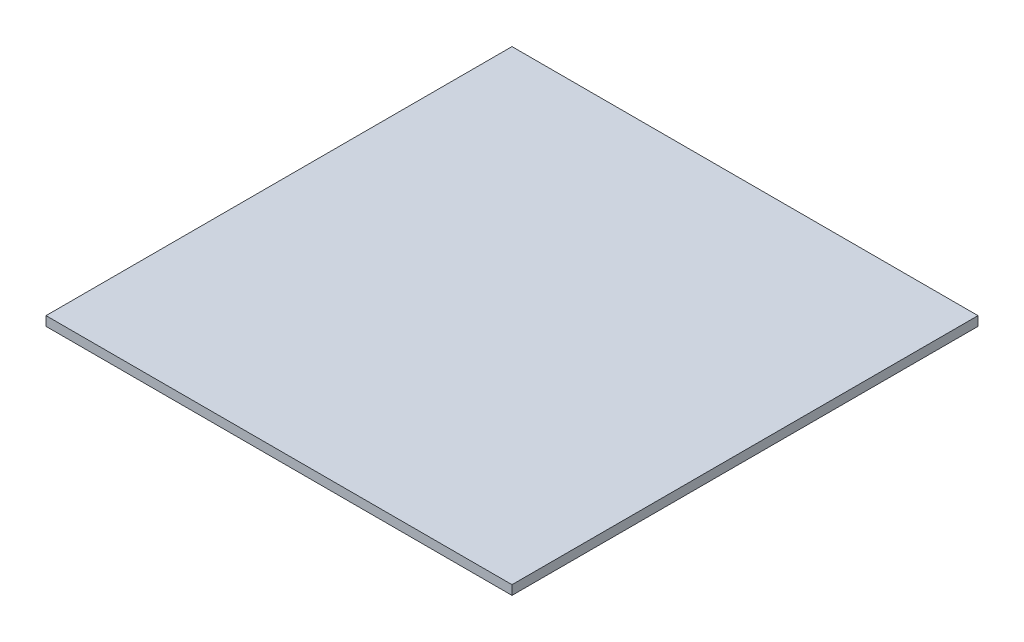
ISO-10303-21;
HEADER;
FILE_DESCRIPTION(('STEP AP214'),'2;1');
FILE_NAME('part.step','',(''),(''),'','','');
FILE_SCHEMA(('AUTOMOTIVE_DESIGN { 1 0 10303 214 1 1 1 1 }'));
ENDSEC;
DATA;
#1=APPLICATION_CONTEXT('core data for automotive mechanical design processes');
#2=APPLICATION_PROTOCOL_DEFINITION('international standard','automotive_design',2000,#1);
#3=PRODUCT_CONTEXT('',#1,'mechanical');
#4=PRODUCT('Part','Part','',(#3));
#5=PRODUCT_RELATED_PRODUCT_CATEGORY('part','',(#4));
#6=PRODUCT_DEFINITION_FORMATION('','',#4);
#7=PRODUCT_DEFINITION_CONTEXT('part definition',#1,'design');
#8=PRODUCT_DEFINITION('design','',#6,#7);
#9=PRODUCT_DEFINITION_SHAPE('','',#8);
#10=(LENGTH_UNIT() NAMED_UNIT(*) SI_UNIT(.MILLI.,.METRE.));
#11=(NAMED_UNIT(*) PLANE_ANGLE_UNIT() SI_UNIT($,.RADIAN.));
#12=(NAMED_UNIT(*) SI_UNIT($,.STERADIAN.) SOLID_ANGLE_UNIT());
#13=UNCERTAINTY_MEASURE_WITH_UNIT(LENGTH_MEASURE(1.E-05),#10,'distance_accuracy_value','');
#14=(GEOMETRIC_REPRESENTATION_CONTEXT(3) GLOBAL_UNCERTAINTY_ASSIGNED_CONTEXT((#13)) GLOBAL_UNIT_ASSIGNED_CONTEXT((#10,
#11,#12)) REPRESENTATION_CONTEXT('',''));
#15=CARTESIAN_POINT('',(0.,0.,0.));
#16=DIRECTION('',(0.,0.,1.));
#17=DIRECTION('',(1.,0.,0.));
#18=AXIS2_PLACEMENT_3D('',#15,#16,#17);
#19=CARTESIAN_POINT('',(500.,20.,-500.));
#20=DIRECTION('',(-1.,0.,0.));
#21=DIRECTION('',(0.,0.,1.));
#22=AXIS2_PLACEMENT_3D('',#19,#20,#21);
#23=PLANE('',#22);
#24=DIRECTION('',(0.,0.,-1.));
#25=VECTOR('',#24,1.);
#26=CARTESIAN_POINT('',(500.,0.,-500.));
#27=LINE('',#26,#25);
#28=CARTESIAN_POINT('',(500.,0.,500.));
#29=VERTEX_POINT('',#28);
#30=CARTESIAN_POINT('',(500.,0.,-500.));
#31=VERTEX_POINT('',#30);
#32=EDGE_CURVE('E109',#29,#31,#27,.T.);
#33=ORIENTED_EDGE('',*,*,#32,.T.);
#34=DIRECTION('',(0.,-1.,0.));
#35=VECTOR('',#34,1.);
#36=CARTESIAN_POINT('',(500.,20.,-500.));
#37=LINE('',#36,#35);
#38=CARTESIAN_POINT('',(500.,20.,-500.));
#39=VERTEX_POINT('',#38);
#40=EDGE_CURVE('E11',#39,#31,#37,.T.);
#41=ORIENTED_EDGE('',*,*,#40,.F.);
#42=DIRECTION('',(0.,0.,-1.));
#43=VECTOR('',#42,1.);
#44=CARTESIAN_POINT('',(500.,20.,-500.));
#45=LINE('',#44,#43);
#46=CARTESIAN_POINT('',(500.,20.,500.));
#47=VERTEX_POINT('',#46);
#48=EDGE_CURVE('E93',#47,#39,#45,.T.);
#49=ORIENTED_EDGE('',*,*,#48,.F.);
#50=DIRECTION('',(0.,-1.,0.));
#51=VECTOR('',#50,1.);
#52=CARTESIAN_POINT('',(500.,20.,500.));
#53=LINE('',#52,#51);
#54=EDGE_CURVE('E105',#47,#29,#53,.T.);
#55=ORIENTED_EDGE('',*,*,#54,.T.);
#56=EDGE_LOOP('',(#33,#41,#49,#55));
#57=FACE_BOUND('',#56,.T.);
#58=ADVANCED_FACE('F41',(#57),#23,.F.);
#59=CARTESIAN_POINT('',(-500.,20.,-500.));
#60=DIRECTION('',(0.,0.,1.));
#61=DIRECTION('',(1.,0.,0.));
#62=AXIS2_PLACEMENT_3D('',#59,#60,#61);
#63=PLANE('',#62);
#64=DIRECTION('',(-1.,0.,0.));
#65=VECTOR('',#64,1.);
#66=CARTESIAN_POINT('',(-500.,0.,-500.));
#67=LINE('',#66,#65);
#68=CARTESIAN_POINT('',(-500.,0.,-500.));
#69=VERTEX_POINT('',#68);
#70=EDGE_CURVE('E98',#31,#69,#67,.T.);
#71=ORIENTED_EDGE('',*,*,#70,.T.);
#72=DIRECTION('',(0.,-1.,0.));
#73=VECTOR('',#72,1.);
#74=CARTESIAN_POINT('',(-500.,20.,-500.));
#75=LINE('',#74,#73);
#76=CARTESIAN_POINT('',(-500.,20.,-500.));
#77=VERTEX_POINT('',#76);
#78=EDGE_CURVE('E50',#77,#69,#75,.T.);
#79=ORIENTED_EDGE('',*,*,#78,.F.);
#80=DIRECTION('',(-1.,0.,0.));
#81=VECTOR('',#80,1.);
#82=CARTESIAN_POINT('',(-500.,20.,-500.));
#83=LINE('',#82,#81);
#84=EDGE_CURVE('E88',#39,#77,#83,.T.);
#85=ORIENTED_EDGE('',*,*,#84,.F.);
#86=ORIENTED_EDGE('',*,*,#40,.T.);
#87=EDGE_LOOP('',(#71,#79,#85,#86));
#88=FACE_BOUND('',#87,.T.);
#89=ADVANCED_FACE('F97',(#88),#63,.F.);
#90=CARTESIAN_POINT('',(-500.,20.,-500.));
#91=DIRECTION('',(1.,0.,0.));
#92=DIRECTION('',(0.,0.,-1.));
#93=AXIS2_PLACEMENT_3D('',#90,#91,#92);
#94=PLANE('',#93);
#95=DIRECTION('',(0.,0.,1.));
#96=VECTOR('',#95,1.);
#97=CARTESIAN_POINT('',(-500.,0.,-500.));
#98=LINE('',#97,#96);
#99=CARTESIAN_POINT('',(-500.,0.,500.));
#100=VERTEX_POINT('',#99);
#101=EDGE_CURVE('E75',#69,#100,#98,.T.);
#102=ORIENTED_EDGE('',*,*,#101,.T.);
#103=DIRECTION('',(0.,-1.,0.));
#104=VECTOR('',#103,1.);
#105=CARTESIAN_POINT('',(-500.,20.,500.));
#106=LINE('',#105,#104);
#107=CARTESIAN_POINT('',(-500.,20.,500.));
#108=VERTEX_POINT('',#107);
#109=EDGE_CURVE('E100',#108,#100,#106,.T.);
#110=ORIENTED_EDGE('',*,*,#109,.F.);
#111=DIRECTION('',(0.,0.,1.));
#112=VECTOR('',#111,1.);
#113=CARTESIAN_POINT('',(-500.,20.,-500.));
#114=LINE('',#113,#112);
#115=EDGE_CURVE('E91',#77,#108,#114,.T.);
#116=ORIENTED_EDGE('',*,*,#115,.F.);
#117=ORIENTED_EDGE('',*,*,#78,.T.);
#118=EDGE_LOOP('',(#102,#110,#116,#117));
#119=FACE_BOUND('',#118,.T.);
#120=ADVANCED_FACE('F101',(#119),#94,.F.);
#121=CARTESIAN_POINT('',(-500.,20.,500.));
#122=DIRECTION('',(0.,0.,-1.));
#123=DIRECTION('',(-1.,0.,0.));
#124=AXIS2_PLACEMENT_3D('',#121,#122,#123);
#125=PLANE('',#124);
#126=DIRECTION('',(1.,0.,0.));
#127=VECTOR('',#126,1.);
#128=CARTESIAN_POINT('',(-500.,0.,500.));
#129=LINE('',#128,#127);
#130=EDGE_CURVE('E81',#100,#29,#129,.T.);
#131=ORIENTED_EDGE('',*,*,#130,.T.);
#132=ORIENTED_EDGE('',*,*,#54,.F.);
#133=DIRECTION('',(1.,0.,0.));
#134=VECTOR('',#133,1.);
#135=CARTESIAN_POINT('',(-500.,20.,500.));
#136=LINE('',#135,#134);
#137=EDGE_CURVE('E58',#108,#47,#136,.T.);
#138=ORIENTED_EDGE('',*,*,#137,.F.);
#139=ORIENTED_EDGE('',*,*,#109,.T.);
#140=EDGE_LOOP('',(#131,#132,#138,#139));
#141=FACE_BOUND('',#140,.T.);
#142=ADVANCED_FACE('F122',(#141),#125,.F.);
#143=CARTESIAN_POINT('',(0.,20.,0.));
#144=DIRECTION('',(0.,1.,0.));
#145=DIRECTION('',(0.,0.,1.));
#146=AXIS2_PLACEMENT_3D('',#143,#144,#145);
#147=PLANE('',#146);
#148=ORIENTED_EDGE('',*,*,#48,.T.);
#149=ORIENTED_EDGE('',*,*,#84,.T.);
#150=ORIENTED_EDGE('',*,*,#115,.T.);
#151=ORIENTED_EDGE('',*,*,#137,.T.);
#152=EDGE_LOOP('',(#148,#149,#150,#151));
#153=FACE_BOUND('',#152,.T.);
#154=ADVANCED_FACE('F89',(#153),#147,.T.);
#155=CARTESIAN_POINT('',(0.,0.,0.));
#156=DIRECTION('',(0.,1.,0.));
#157=DIRECTION('',(0.,0.,1.));
#158=AXIS2_PLACEMENT_3D('',#155,#156,#157);
#159=PLANE('',#158);
#160=ORIENTED_EDGE('',*,*,#32,.F.);
#161=ORIENTED_EDGE('',*,*,#130,.F.);
#162=ORIENTED_EDGE('',*,*,#101,.F.);
#163=ORIENTED_EDGE('',*,*,#70,.F.);
#164=EDGE_LOOP('',(#160,#161,#162,#163));
#165=FACE_BOUND('',#164,.T.);
#166=ADVANCED_FACE('F125',(#165),#159,.F.);
#167=CLOSED_SHELL('',(#58,#89,#120,#142,#154,#166));
#168=MANIFOLD_SOLID_BREP('B2',#167);
#169=ADVANCED_BREP_SHAPE_REPRESENTATION('',(#18,#168),#14);
#170=SHAPE_DEFINITION_REPRESENTATION(#9,#169);
ENDSEC;
END-ISO-10303-21;
